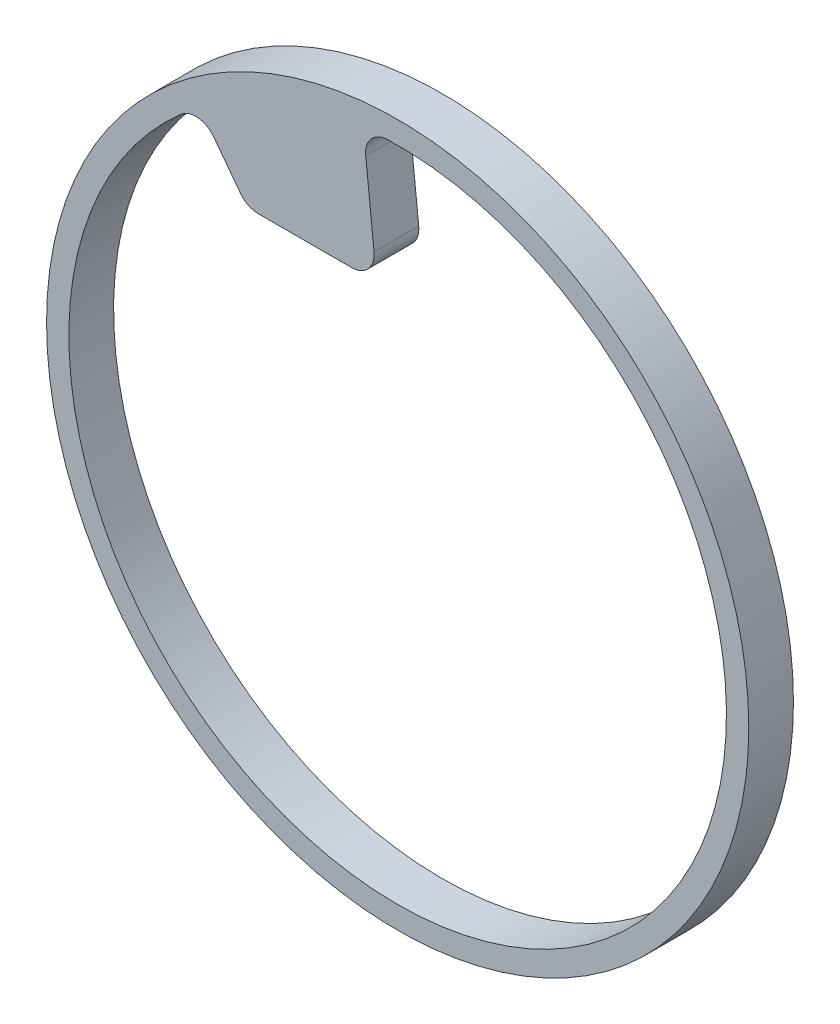
ISO-10303-21;
HEADER;
FILE_DESCRIPTION(('STEP AP214'),'2;1');
FILE_NAME('part.step','',(''),(''),'','','');
FILE_SCHEMA(('AUTOMOTIVE_DESIGN { 1 0 10303 214 1 1 1 1 }'));
ENDSEC;
DATA;
#1=APPLICATION_CONTEXT('core data for automotive mechanical design processes');
#2=APPLICATION_PROTOCOL_DEFINITION('international standard','automotive_design',2000,#1);
#3=PRODUCT_CONTEXT('',#1,'mechanical');
#4=PRODUCT('Part','Part','',(#3));
#5=PRODUCT_RELATED_PRODUCT_CATEGORY('part','',(#4));
#6=PRODUCT_DEFINITION_FORMATION('','',#4);
#7=PRODUCT_DEFINITION_CONTEXT('part definition',#1,'design');
#8=PRODUCT_DEFINITION('design','',#6,#7);
#9=PRODUCT_DEFINITION_SHAPE('','',#8);
#10=(LENGTH_UNIT() NAMED_UNIT(*) SI_UNIT(.MILLI.,.METRE.));
#11=(NAMED_UNIT(*) PLANE_ANGLE_UNIT() SI_UNIT($,.RADIAN.));
#12=(NAMED_UNIT(*) SI_UNIT($,.STERADIAN.) SOLID_ANGLE_UNIT());
#13=UNCERTAINTY_MEASURE_WITH_UNIT(LENGTH_MEASURE(1.E-05),#10,'distance_accuracy_value','');
#14=(GEOMETRIC_REPRESENTATION_CONTEXT(3) GLOBAL_UNCERTAINTY_ASSIGNED_CONTEXT((#13)) GLOBAL_UNIT_ASSIGNED_CONTEXT((#10,
#11,#12)) REPRESENTATION_CONTEXT('',''));
#15=CARTESIAN_POINT('',(0.,0.,0.));
#16=DIRECTION('',(0.,0.,1.));
#17=DIRECTION('',(1.,0.,0.));
#18=AXIS2_PLACEMENT_3D('',#15,#16,#17);
#19=CARTESIAN_POINT('',(0.,0.,3.175));
#20=DIRECTION('',(0.,0.,1.));
#21=DIRECTION('',(1.,0.,0.));
#22=AXIS2_PLACEMENT_3D('',#19,#20,#21);
#23=PLANE('',#22);
#24=CARTESIAN_POINT('',(0.,0.,3.175));
#25=DIRECTION('',(0.,0.,1.));
#26=DIRECTION('',(1.,0.,0.));
#27=AXIS2_PLACEMENT_3D('',#24,#25,#26);
#28=CIRCLE('',#27,24.9555);
#29=CARTESIAN_POINT('',(24.9555,0.,3.175));
#30=VERTEX_POINT('',#29);
#31=EDGE_CURVE('E118',#30,#30,#28,.T.);
#32=ORIENTED_EDGE('',*,*,#31,.T.);
#33=EDGE_LOOP('',(#32));
#34=FACE_BOUND('',#33,.T.);
#35=DIRECTION('',(1.,0.,0.));
#36=VECTOR('',#35,1.);
#37=CARTESIAN_POINT('',(-10.7002711116435,14.1997393686408,3.175));
#38=LINE('',#37,#36);
#39=CARTESIAN_POINT('',(-9.90244082243636,14.1997393686408,3.175));
#40=VERTEX_POINT('',#39);
#41=CARTESIAN_POINT('',(-3.2696548935426,14.1997393686408,3.175));
#42=VERTEX_POINT('',#41);
#43=EDGE_CURVE('E100',#40,#42,#38,.T.);
#44=ORIENTED_EDGE('',*,*,#43,.T.);
#45=CARTESIAN_POINT('',(-3.2696548935426,15.7999393686408,3.175));
#46=DIRECTION('',(0.,0.,1.));
#47=DIRECTION('',(1.,0.,0.));
#48=AXIS2_PLACEMENT_3D('',#45,#46,#47);
#49=CIRCLE('',#48,1.6002);
#50=CARTESIAN_POINT('',(-1.67822095657429,15.9672058155618,3.175));
#51=VERTEX_POINT('',#50);
#52=EDGE_CURVE('E106',#42,#51,#49,.T.);
#53=ORIENTED_EDGE('',*,*,#52,.T.);
#54=DIRECTION('',(-0.104528463267654,0.994521895368273,0.));
#55=VECTOR('',#54,1.);
#56=CARTESIAN_POINT('',(-2.44262112963855,23.2399876509658,3.175));
#57=LINE('',#56,#55);
#58=CARTESIAN_POINT('',(-2.26919828747943,21.5899795259769,3.175));
#59=VERTEX_POINT('',#58);
#60=EDGE_CURVE('E115',#51,#59,#57,.T.);
#61=ORIENTED_EDGE('',*,*,#60,.T.);
#62=CARTESIAN_POINT('',(-0.677764350511119,21.7572459728978,3.175));
#63=DIRECTION('',(0.,0.,1.));
#64=DIRECTION('',(1.,0.,0.));
#65=AXIS2_PLACEMENT_3D('',#62,#63,#64);
#66=CIRCLE('',#65,1.6002);
#67=CARTESIAN_POINT('',(-0.727588334270979,23.3566701225974,3.175));
#68=VERTEX_POINT('',#67);
#69=EDGE_CURVE('E40',#59,#68,#66,.F.);
#70=ORIENTED_EDGE('',*,*,#69,.T.);
#71=CARTESIAN_POINT('',(0.,0.,3.175));
#72=DIRECTION('',(0.,0.,1.));
#73=DIRECTION('',(1.,0.,0.));
#74=AXIS2_PLACEMENT_3D('',#71,#72,#73);
#75=CIRCLE('',#74,23.368);
#76=CARTESIAN_POINT('',(-15.3970862986082,17.5782012024328,3.175));
#77=VERTEX_POINT('',#76);
#78=EDGE_CURVE('E149',#77,#68,#75,.T.);
#79=ORIENTED_EDGE('',*,*,#78,.F.);
#80=CARTESIAN_POINT('',(-14.3427206064209,16.3744765548749,3.175));
#81=DIRECTION('',(0.,0.,1.));
#82=DIRECTION('',(1.,0.,0.));
#83=AXIS2_PLACEMENT_3D('',#80,#81,#82);
#84=CIRCLE('',#83,1.6002);
#85=CARTESIAN_POINT('',(-13.0647440632432,17.3375009549229,3.175));
#86=VERTEX_POINT('',#85);
#87=EDGE_CURVE('E143',#77,#86,#84,.F.);
#88=ORIENTED_EDGE('',*,*,#87,.T.);
#89=DIRECTION('',(0.601815023152049,-0.798635510047292,0.));
#90=VECTOR('',#89,1.);
#91=CARTESIAN_POINT('',(-14.0632134610171,18.6625145987851,3.175));
#92=LINE('',#91,#90);
#93=CARTESIAN_POINT('',(-11.180417365614,14.8369149685929,3.175));
#94=VERTEX_POINT('',#93);
#95=EDGE_CURVE('E101',#86,#94,#92,.T.);
#96=ORIENTED_EDGE('',*,*,#95,.T.);
#97=CARTESIAN_POINT('',(-9.90244082243636,15.7999393686408,3.175));
#98=DIRECTION('',(0.,0.,1.));
#99=DIRECTION('',(1.,0.,0.));
#100=AXIS2_PLACEMENT_3D('',#97,#98,#99);
#101=CIRCLE('',#100,1.6002);
#102=EDGE_CURVE('E98',#94,#40,#101,.T.);
#103=ORIENTED_EDGE('',*,*,#102,.T.);
#104=EDGE_LOOP('',(#44,#53,#61,#70,#79,#88,#96,#103));
#105=FACE_BOUND('',#104,.T.);
#106=ADVANCED_FACE('F32',(#34,#105),#23,.T.);
#107=CARTESIAN_POINT('',(0.,0.,0.));
#108=DIRECTION('',(0.,0.,1.));
#109=DIRECTION('',(1.,0.,0.));
#110=AXIS2_PLACEMENT_3D('',#107,#108,#109);
#111=PLANE('',#110);
#112=CARTESIAN_POINT('',(0.,0.,0.));
#113=DIRECTION('',(0.,0.,1.));
#114=DIRECTION('',(1.,0.,0.));
#115=AXIS2_PLACEMENT_3D('',#112,#113,#114);
#116=CIRCLE('',#115,24.9555);
#117=CARTESIAN_POINT('',(24.9555,0.,0.));
#118=VERTEX_POINT('',#117);
#119=EDGE_CURVE('E122',#118,#118,#116,.T.);
#120=ORIENTED_EDGE('',*,*,#119,.F.);
#121=EDGE_LOOP('',(#120));
#122=FACE_BOUND('',#121,.T.);
#123=DIRECTION('',(-0.104528463267654,0.994521895368273,0.));
#124=VECTOR('',#123,1.);
#125=CARTESIAN_POINT('',(-2.44262112963855,23.2399876509658,0.));
#126=LINE('',#125,#124);
#127=CARTESIAN_POINT('',(-1.67822095657429,15.9672058155618,0.));
#128=VERTEX_POINT('',#127);
#129=CARTESIAN_POINT('',(-2.26919828747943,21.5899795259769,0.));
#130=VERTEX_POINT('',#129);
#131=EDGE_CURVE('E165',#128,#130,#126,.T.);
#132=ORIENTED_EDGE('',*,*,#131,.F.);
#133=CARTESIAN_POINT('',(-3.2696548935426,15.7999393686408,0.));
#134=DIRECTION('',(0.,0.,1.));
#135=DIRECTION('',(1.,0.,0.));
#136=AXIS2_PLACEMENT_3D('',#133,#134,#135);
#137=CIRCLE('',#136,1.6002);
#138=CARTESIAN_POINT('',(-3.2696548935426,14.1997393686408,0.));
#139=VERTEX_POINT('',#138);
#140=EDGE_CURVE('E133',#128,#139,#137,.F.);
#141=ORIENTED_EDGE('',*,*,#140,.T.);
#142=DIRECTION('',(1.,0.,0.));
#143=VECTOR('',#142,1.);
#144=CARTESIAN_POINT('',(-10.7002711116435,14.1997393686408,0.));
#145=LINE('',#144,#143);
#146=CARTESIAN_POINT('',(-9.90244082243636,14.1997393686408,0.));
#147=VERTEX_POINT('',#146);
#148=EDGE_CURVE('E170',#147,#139,#145,.T.);
#149=ORIENTED_EDGE('',*,*,#148,.F.);
#150=CARTESIAN_POINT('',(-9.90244082243636,15.7999393686408,0.));
#151=DIRECTION('',(0.,0.,1.));
#152=DIRECTION('',(1.,0.,0.));
#153=AXIS2_PLACEMENT_3D('',#150,#151,#152);
#154=CIRCLE('',#153,1.6002);
#155=CARTESIAN_POINT('',(-11.180417365614,14.8369149685929,0.));
#156=VERTEX_POINT('',#155);
#157=EDGE_CURVE('E47',#147,#156,#154,.F.);
#158=ORIENTED_EDGE('',*,*,#157,.T.);
#159=DIRECTION('',(0.601815023152049,-0.798635510047292,0.));
#160=VECTOR('',#159,1.);
#161=CARTESIAN_POINT('',(-14.0632134610171,18.6625145987851,0.));
#162=LINE('',#161,#160);
#163=CARTESIAN_POINT('',(-13.0647440632432,17.3375009549229,0.));
#164=VERTEX_POINT('',#163);
#165=EDGE_CURVE('E173',#164,#156,#162,.T.);
#166=ORIENTED_EDGE('',*,*,#165,.F.);
#167=CARTESIAN_POINT('',(-14.3427206064209,16.3744765548749,0.));
#168=DIRECTION('',(0.,0.,1.));
#169=DIRECTION('',(1.,0.,0.));
#170=AXIS2_PLACEMENT_3D('',#167,#168,#169);
#171=CIRCLE('',#170,1.6002);
#172=CARTESIAN_POINT('',(-15.3970862986082,17.5782012024328,0.));
#173=VERTEX_POINT('',#172);
#174=EDGE_CURVE('E145',#164,#173,#171,.T.);
#175=ORIENTED_EDGE('',*,*,#174,.T.);
#176=CARTESIAN_POINT('',(0.,0.,0.));
#177=DIRECTION('',(0.,0.,1.));
#178=DIRECTION('',(1.,0.,0.));
#179=AXIS2_PLACEMENT_3D('',#176,#177,#178);
#180=CIRCLE('',#179,23.368);
#181=CARTESIAN_POINT('',(-0.727588334270979,23.3566701225974,0.));
#182=VERTEX_POINT('',#181);
#183=EDGE_CURVE('E159',#173,#182,#180,.T.);
#184=ORIENTED_EDGE('',*,*,#183,.T.);
#185=CARTESIAN_POINT('',(-0.677764350511119,21.7572459728978,0.));
#186=DIRECTION('',(0.,0.,1.));
#187=DIRECTION('',(1.,0.,0.));
#188=AXIS2_PLACEMENT_3D('',#185,#186,#187);
#189=CIRCLE('',#188,1.6002);
#190=EDGE_CURVE('E11',#182,#130,#189,.T.);
#191=ORIENTED_EDGE('',*,*,#190,.T.);
#192=EDGE_LOOP('',(#132,#141,#149,#158,#166,#175,#184,#191));
#193=FACE_BOUND('',#192,.T.);
#194=ADVANCED_FACE('F164',(#122,#193),#111,.F.);
#195=CARTESIAN_POINT('',(0.,0.,3.175));
#196=DIRECTION('',(0.,0.,-1.));
#197=DIRECTION('',(-1.,0.,0.));
#198=AXIS2_PLACEMENT_3D('',#195,#196,#197);
#199=CYLINDRICAL_SURFACE('',#198,24.9555);
#200=ORIENTED_EDGE('',*,*,#31,.F.);
#201=EDGE_LOOP('',(#200));
#202=FACE_BOUND('',#201,.T.);
#203=ORIENTED_EDGE('',*,*,#119,.T.);
#204=EDGE_LOOP('',(#203));
#205=FACE_BOUND('',#204,.T.);
#206=ADVANCED_FACE('F195',(#202,#205),#199,.T.);
#207=CARTESIAN_POINT('',(0.,0.,3.175));
#208=DIRECTION('',(0.,0.,-1.));
#209=DIRECTION('',(-1.,0.,0.));
#210=AXIS2_PLACEMENT_3D('',#207,#208,#209);
#211=CYLINDRICAL_SURFACE('',#210,23.368);
#212=ORIENTED_EDGE('',*,*,#183,.F.);
#213=DIRECTION('',(0.,0.,-1.));
#214=VECTOR('',#213,1.);
#215=CARTESIAN_POINT('',(-15.3970862986082,17.5782012024329,3.175));
#216=LINE('',#215,#214);
#217=EDGE_CURVE('E140',#173,#77,#216,.F.);
#218=ORIENTED_EDGE('',*,*,#217,.T.);
#219=ORIENTED_EDGE('',*,*,#78,.T.);
#220=DIRECTION('',(0.,0.,-1.));
#221=VECTOR('',#220,1.);
#222=CARTESIAN_POINT('',(-0.72758833427098,23.3566701225974,3.175));
#223=LINE('',#222,#221);
#224=EDGE_CURVE('E138',#68,#182,#223,.T.);
#225=ORIENTED_EDGE('',*,*,#224,.T.);
#226=EDGE_LOOP('',(#212,#218,#219,#225));
#227=FACE_BOUND('',#226,.T.);
#228=ADVANCED_FACE('F156',(#227),#211,.F.);
#229=CARTESIAN_POINT('',(-2.44262112963855,23.2399876509658,0.));
#230=DIRECTION('',(0.994521895368273,0.104528463267654,0.));
#231=DIRECTION('',(-0.104528463267654,0.994521895368273,0.));
#232=AXIS2_PLACEMENT_3D('',#229,#230,#231);
#233=PLANE('',#232);
#234=ORIENTED_EDGE('',*,*,#60,.F.);
#235=DIRECTION('',(0.,0.,1.));
#236=VECTOR('',#235,1.);
#237=CARTESIAN_POINT('',(-1.67822095657429,15.9672058155618,0.));
#238=LINE('',#237,#236);
#239=EDGE_CURVE('E130',#51,#128,#238,.F.);
#240=ORIENTED_EDGE('',*,*,#239,.T.);
#241=ORIENTED_EDGE('',*,*,#131,.T.);
#242=DIRECTION('',(0.,0.,1.));
#243=VECTOR('',#242,1.);
#244=CARTESIAN_POINT('',(-2.26919828747943,21.5899795259769,3.175));
#245=LINE('',#244,#243);
#246=EDGE_CURVE('E127',#130,#59,#245,.T.);
#247=ORIENTED_EDGE('',*,*,#246,.T.);
#248=EDGE_LOOP('',(#234,#240,#241,#247));
#249=FACE_BOUND('',#248,.T.);
#250=ADVANCED_FACE('F168',(#249),#233,.T.);
#251=CARTESIAN_POINT('',(-10.7002711116435,14.1997393686408,0.));
#252=DIRECTION('',(0.,-1.,0.));
#253=DIRECTION('',(0.,0.,-1.));
#254=AXIS2_PLACEMENT_3D('',#251,#252,#253);
#255=PLANE('',#254);
#256=ORIENTED_EDGE('',*,*,#148,.T.);
#257=DIRECTION('',(0.,0.,1.));
#258=VECTOR('',#257,1.);
#259=CARTESIAN_POINT('',(-3.2696548935426,14.1997393686408,0.));
#260=LINE('',#259,#258);
#261=EDGE_CURVE('E107',#139,#42,#260,.T.);
#262=ORIENTED_EDGE('',*,*,#261,.T.);
#263=ORIENTED_EDGE('',*,*,#43,.F.);
#264=DIRECTION('',(0.,0.,1.));
#265=VECTOR('',#264,1.);
#266=CARTESIAN_POINT('',(-9.90244082243636,14.1997393686408,0.));
#267=LINE('',#266,#265);
#268=EDGE_CURVE('E113',#40,#147,#267,.F.);
#269=ORIENTED_EDGE('',*,*,#268,.T.);
#270=EDGE_LOOP('',(#256,#262,#263,#269));
#271=FACE_BOUND('',#270,.T.);
#272=ADVANCED_FACE('F112',(#271),#255,.T.);
#273=CARTESIAN_POINT('',(-14.0632134610171,18.6625145987851,0.));
#274=DIRECTION('',(-0.798635510047292,-0.601815023152049,0.));
#275=DIRECTION('',(0.601815023152049,-0.798635510047292,0.));
#276=AXIS2_PLACEMENT_3D('',#273,#274,#275);
#277=PLANE('',#276);
#278=ORIENTED_EDGE('',*,*,#165,.T.);
#279=DIRECTION('',(0.,0.,1.));
#280=VECTOR('',#279,1.);
#281=CARTESIAN_POINT('',(-11.180417365614,14.8369149685929,0.));
#282=LINE('',#281,#280);
#283=EDGE_CURVE('E136',#156,#94,#282,.T.);
#284=ORIENTED_EDGE('',*,*,#283,.T.);
#285=ORIENTED_EDGE('',*,*,#95,.F.);
#286=DIRECTION('',(0.,0.,1.));
#287=VECTOR('',#286,1.);
#288=CARTESIAN_POINT('',(-13.0647440632432,17.3375009549229,0.));
#289=LINE('',#288,#287);
#290=EDGE_CURVE('E54',#86,#164,#289,.F.);
#291=ORIENTED_EDGE('',*,*,#290,.T.);
#292=EDGE_LOOP('',(#278,#284,#285,#291));
#293=FACE_BOUND('',#292,.T.);
#294=ADVANCED_FACE('F178',(#293),#277,.T.);
#295=CARTESIAN_POINT('',(-3.2696548935426,15.7999393686408,0.));
#296=DIRECTION('',(0.,0.,1.));
#297=DIRECTION('',(1.,0.,0.));
#298=AXIS2_PLACEMENT_3D('',#295,#296,#297);
#299=CYLINDRICAL_SURFACE('',#298,1.6002);
#300=ORIENTED_EDGE('',*,*,#140,.F.);
#301=ORIENTED_EDGE('',*,*,#239,.F.);
#302=ORIENTED_EDGE('',*,*,#52,.F.);
#303=ORIENTED_EDGE('',*,*,#261,.F.);
#304=EDGE_LOOP('',(#300,#301,#302,#303));
#305=FACE_BOUND('',#304,.T.);
#306=ADVANCED_FACE('F187',(#305),#299,.T.);
#307=CARTESIAN_POINT('',(-9.90244082243636,15.7999393686408,0.));
#308=DIRECTION('',(0.,0.,1.));
#309=DIRECTION('',(1.,0.,0.));
#310=AXIS2_PLACEMENT_3D('',#307,#308,#309);
#311=CYLINDRICAL_SURFACE('',#310,1.6002);
#312=ORIENTED_EDGE('',*,*,#157,.F.);
#313=ORIENTED_EDGE('',*,*,#268,.F.);
#314=ORIENTED_EDGE('',*,*,#102,.F.);
#315=ORIENTED_EDGE('',*,*,#283,.F.);
#316=EDGE_LOOP('',(#312,#313,#314,#315));
#317=FACE_BOUND('',#316,.T.);
#318=ADVANCED_FACE('F117',(#317),#311,.T.);
#319=CARTESIAN_POINT('',(-14.3427206064209,16.3744765548749,3.175));
#320=DIRECTION('',(0.,0.,-1.));
#321=DIRECTION('',(-1.,0.,0.));
#322=AXIS2_PLACEMENT_3D('',#319,#320,#321);
#323=CYLINDRICAL_SURFACE('',#322,1.6002);
#324=ORIENTED_EDGE('',*,*,#174,.F.);
#325=ORIENTED_EDGE('',*,*,#290,.F.);
#326=ORIENTED_EDGE('',*,*,#87,.F.);
#327=ORIENTED_EDGE('',*,*,#217,.F.);
#328=EDGE_LOOP('',(#324,#325,#326,#327));
#329=FACE_BOUND('',#328,.T.);
#330=ADVANCED_FACE('F181',(#329),#323,.F.);
#331=CARTESIAN_POINT('',(-0.677764350511119,21.7572459728978,3.175));
#332=DIRECTION('',(0.,0.,-1.));
#333=DIRECTION('',(-1.,0.,0.));
#334=AXIS2_PLACEMENT_3D('',#331,#332,#333);
#335=CYLINDRICAL_SURFACE('',#334,1.6002);
#336=ORIENTED_EDGE('',*,*,#190,.F.);
#337=ORIENTED_EDGE('',*,*,#224,.F.);
#338=ORIENTED_EDGE('',*,*,#69,.F.);
#339=ORIENTED_EDGE('',*,*,#246,.F.);
#340=EDGE_LOOP('',(#336,#337,#338,#339));
#341=FACE_BOUND('',#340,.T.);
#342=ADVANCED_FACE('F34',(#341),#335,.F.);
#343=CLOSED_SHELL('',(#106,#194,#206,#228,#250,#272,#294,#306,#318,#330,#342));
#344=MANIFOLD_SOLID_BREP('B2',#343);
#345=ADVANCED_BREP_SHAPE_REPRESENTATION('',(#18,#344),#14);
#346=SHAPE_DEFINITION_REPRESENTATION(#9,#345);
ENDSEC;
END-ISO-10303-21;
